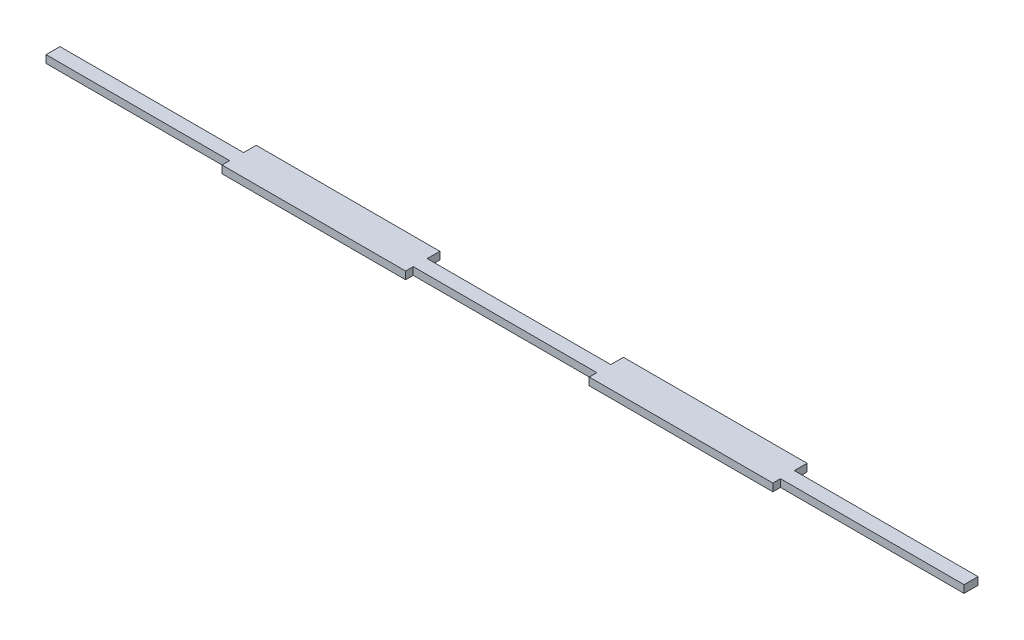
ISO-10303-21;
HEADER;
FILE_DESCRIPTION(('STEP AP214'),'2;1');
FILE_NAME('part.step','',(''),(''),'','','');
FILE_SCHEMA(('AUTOMOTIVE_DESIGN { 1 0 10303 214 1 1 1 1 }'));
ENDSEC;
DATA;
#1=APPLICATION_CONTEXT('core data for automotive mechanical design processes');
#2=APPLICATION_PROTOCOL_DEFINITION('international standard','automotive_design',2000,#1);
#3=PRODUCT_CONTEXT('',#1,'mechanical');
#4=PRODUCT('Part','Part','',(#3));
#5=PRODUCT_RELATED_PRODUCT_CATEGORY('part','',(#4));
#6=PRODUCT_DEFINITION_FORMATION('','',#4);
#7=PRODUCT_DEFINITION_CONTEXT('part definition',#1,'design');
#8=PRODUCT_DEFINITION('design','',#6,#7);
#9=PRODUCT_DEFINITION_SHAPE('','',#8);
#10=(LENGTH_UNIT() NAMED_UNIT(*) SI_UNIT(.MILLI.,.METRE.));
#11=(NAMED_UNIT(*) PLANE_ANGLE_UNIT() SI_UNIT($,.RADIAN.));
#12=(NAMED_UNIT(*) SI_UNIT($,.STERADIAN.) SOLID_ANGLE_UNIT());
#13=UNCERTAINTY_MEASURE_WITH_UNIT(LENGTH_MEASURE(1.E-05),#10,'distance_accuracy_value','');
#14=(GEOMETRIC_REPRESENTATION_CONTEXT(3) GLOBAL_UNCERTAINTY_ASSIGNED_CONTEXT((#13)) GLOBAL_UNIT_ASSIGNED_CONTEXT((#10,
#11,#12)) REPRESENTATION_CONTEXT('',''));
#15=CARTESIAN_POINT('',(0.,0.,0.));
#16=DIRECTION('',(0.,0.,1.));
#17=DIRECTION('',(1.,0.,0.));
#18=AXIS2_PLACEMENT_3D('',#15,#16,#17);
#19=CARTESIAN_POINT('',(-108.69,3.,-1.75));
#20=DIRECTION('',(0.,0.,1.));
#21=DIRECTION('',(1.,0.,0.));
#22=AXIS2_PLACEMENT_3D('',#19,#20,#21);
#23=PLANE('',#22);
#24=DIRECTION('',(-1.,0.,0.));
#25=VECTOR('',#24,1.);
#26=CARTESIAN_POINT('',(-108.69,0.,-1.75));
#27=LINE('',#26,#25);
#28=CARTESIAN_POINT('',(-108.69,0.,-1.75));
#29=VERTEX_POINT('',#28);
#30=CARTESIAN_POINT('',(-181.15,0.,-1.75));
#31=VERTEX_POINT('',#30);
#32=EDGE_CURVE('E200',#29,#31,#27,.T.);
#33=ORIENTED_EDGE('',*,*,#32,.T.);
#34=DIRECTION('',(0.,-1.,0.));
#35=VECTOR('',#34,1.);
#36=CARTESIAN_POINT('',(-181.15,3.,-1.75));
#37=LINE('',#36,#35);
#38=CARTESIAN_POINT('',(-181.15,3.,-1.75));
#39=VERTEX_POINT('',#38);
#40=EDGE_CURVE('E11',#39,#31,#37,.T.);
#41=ORIENTED_EDGE('',*,*,#40,.F.);
#42=DIRECTION('',(-1.,0.,0.));
#43=VECTOR('',#42,1.);
#44=CARTESIAN_POINT('',(-108.69,3.,-1.75));
#45=LINE('',#44,#43);
#46=CARTESIAN_POINT('',(-108.69,3.,-1.75));
#47=VERTEX_POINT('',#46);
#48=EDGE_CURVE('E238',#47,#39,#45,.T.);
#49=ORIENTED_EDGE('',*,*,#48,.F.);
#50=DIRECTION('',(0.,-1.,0.));
#51=VECTOR('',#50,1.);
#52=CARTESIAN_POINT('',(-108.69,3.,-1.75));
#53=LINE('',#52,#51);
#54=EDGE_CURVE('E196',#47,#29,#53,.T.);
#55=ORIENTED_EDGE('',*,*,#54,.T.);
#56=EDGE_LOOP('',(#33,#41,#49,#55));
#57=FACE_BOUND('',#56,.T.);
#58=ADVANCED_FACE('F32',(#57),#23,.F.);
#59=CARTESIAN_POINT('',(-181.15,3.,-1.75));
#60=DIRECTION('',(1.,0.,0.));
#61=DIRECTION('',(0.,0.,-1.));
#62=AXIS2_PLACEMENT_3D('',#59,#60,#61);
#63=PLANE('',#62);
#64=DIRECTION('',(0.,0.,1.));
#65=VECTOR('',#64,1.);
#66=CARTESIAN_POINT('',(-181.15,0.,-1.75));
#67=LINE('',#66,#65);
#68=CARTESIAN_POINT('',(-181.15,0.,3.75));
#69=VERTEX_POINT('',#68);
#70=EDGE_CURVE('E203',#31,#69,#67,.T.);
#71=ORIENTED_EDGE('',*,*,#70,.T.);
#72=DIRECTION('',(0.,-1.,0.));
#73=VECTOR('',#72,1.);
#74=CARTESIAN_POINT('',(-181.15,3.,3.75));
#75=LINE('',#74,#73);
#76=CARTESIAN_POINT('',(-181.15,3.,3.75));
#77=VERTEX_POINT('',#76);
#78=EDGE_CURVE('E40',#77,#69,#75,.T.);
#79=ORIENTED_EDGE('',*,*,#78,.F.);
#80=DIRECTION('',(0.,0.,1.));
#81=VECTOR('',#80,1.);
#82=CARTESIAN_POINT('',(-181.15,3.,-1.75));
#83=LINE('',#82,#81);
#84=EDGE_CURVE('E127',#39,#77,#83,.T.);
#85=ORIENTED_EDGE('',*,*,#84,.F.);
#86=ORIENTED_EDGE('',*,*,#40,.T.);
#87=EDGE_LOOP('',(#71,#79,#85,#86));
#88=FACE_BOUND('',#87,.T.);
#89=ADVANCED_FACE('F356',(#88),#63,.F.);
#90=CARTESIAN_POINT('',(-181.15,3.,3.75));
#91=DIRECTION('',(0.,0.,-1.));
#92=DIRECTION('',(-1.,0.,0.));
#93=AXIS2_PLACEMENT_3D('',#90,#91,#92);
#94=PLANE('',#93);
#95=DIRECTION('',(1.,0.,0.));
#96=VECTOR('',#95,1.);
#97=CARTESIAN_POINT('',(-181.15,0.,3.75));
#98=LINE('',#97,#96);
#99=CARTESIAN_POINT('',(-108.69,0.,3.75));
#100=VERTEX_POINT('',#99);
#101=EDGE_CURVE('E205',#69,#100,#98,.T.);
#102=ORIENTED_EDGE('',*,*,#101,.T.);
#103=DIRECTION('',(0.,-1.,0.));
#104=VECTOR('',#103,1.);
#105=CARTESIAN_POINT('',(-108.69,3.,3.75));
#106=LINE('',#105,#104);
#107=CARTESIAN_POINT('',(-108.69,3.,3.75));
#108=VERTEX_POINT('',#107);
#109=EDGE_CURVE('E281',#108,#100,#106,.T.);
#110=ORIENTED_EDGE('',*,*,#109,.F.);
#111=DIRECTION('',(1.,0.,0.));
#112=VECTOR('',#111,1.);
#113=CARTESIAN_POINT('',(-181.15,3.,3.75));
#114=LINE('',#113,#112);
#115=EDGE_CURVE('E289',#77,#108,#114,.T.);
#116=ORIENTED_EDGE('',*,*,#115,.F.);
#117=ORIENTED_EDGE('',*,*,#78,.T.);
#118=EDGE_LOOP('',(#102,#110,#116,#117));
#119=FACE_BOUND('',#118,.T.);
#120=ADVANCED_FACE('F287',(#119),#94,.F.);
#121=CARTESIAN_POINT('',(-108.69,3.,3.75));
#122=DIRECTION('',(1.,0.,0.));
#123=DIRECTION('',(0.,0.,-1.));
#124=AXIS2_PLACEMENT_3D('',#121,#122,#123);
#125=PLANE('',#124);
#126=DIRECTION('',(0.,0.,1.));
#127=VECTOR('',#126,1.);
#128=CARTESIAN_POINT('',(-108.69,0.,3.75));
#129=LINE('',#128,#127);
#130=CARTESIAN_POINT('',(-108.69,0.,6.75));
#131=VERTEX_POINT('',#130);
#132=EDGE_CURVE('E207',#100,#131,#129,.T.);
#133=ORIENTED_EDGE('',*,*,#132,.T.);
#134=DIRECTION('',(0.,-1.,0.));
#135=VECTOR('',#134,1.);
#136=CARTESIAN_POINT('',(-108.69,3.,6.75));
#137=LINE('',#136,#135);
#138=CARTESIAN_POINT('',(-108.69,3.,6.75));
#139=VERTEX_POINT('',#138);
#140=EDGE_CURVE('E278',#139,#131,#137,.T.);
#141=ORIENTED_EDGE('',*,*,#140,.F.);
#142=DIRECTION('',(0.,0.,1.));
#143=VECTOR('',#142,1.);
#144=CARTESIAN_POINT('',(-108.69,3.,3.75));
#145=LINE('',#144,#143);
#146=EDGE_CURVE('E307',#108,#139,#145,.T.);
#147=ORIENTED_EDGE('',*,*,#146,.F.);
#148=ORIENTED_EDGE('',*,*,#109,.T.);
#149=EDGE_LOOP('',(#133,#141,#147,#148));
#150=FACE_BOUND('',#149,.T.);
#151=ADVANCED_FACE('F298',(#150),#125,.F.);
#152=CARTESIAN_POINT('',(-108.69,3.,6.75));
#153=DIRECTION('',(0.,0.,-1.));
#154=DIRECTION('',(-1.,0.,0.));
#155=AXIS2_PLACEMENT_3D('',#152,#153,#154);
#156=PLANE('',#155);
#157=DIRECTION('',(1.,0.,0.));
#158=VECTOR('',#157,1.);
#159=CARTESIAN_POINT('',(-108.69,0.,6.75));
#160=LINE('',#159,#158);
#161=CARTESIAN_POINT('',(-36.23,0.,6.75));
#162=VERTEX_POINT('',#161);
#163=EDGE_CURVE('E209',#131,#162,#160,.T.);
#164=ORIENTED_EDGE('',*,*,#163,.T.);
#165=DIRECTION('',(0.,-1.,0.));
#166=VECTOR('',#165,1.);
#167=CARTESIAN_POINT('',(-36.23,3.,6.75));
#168=LINE('',#167,#166);
#169=CARTESIAN_POINT('',(-36.23,3.,6.75));
#170=VERTEX_POINT('',#169);
#171=EDGE_CURVE('E275',#170,#162,#168,.T.);
#172=ORIENTED_EDGE('',*,*,#171,.F.);
#173=DIRECTION('',(1.,0.,0.));
#174=VECTOR('',#173,1.);
#175=CARTESIAN_POINT('',(-108.69,3.,6.75));
#176=LINE('',#175,#174);
#177=EDGE_CURVE('E304',#139,#170,#176,.T.);
#178=ORIENTED_EDGE('',*,*,#177,.F.);
#179=ORIENTED_EDGE('',*,*,#140,.T.);
#180=EDGE_LOOP('',(#164,#172,#178,#179));
#181=FACE_BOUND('',#180,.T.);
#182=ADVANCED_FACE('F302',(#181),#156,.F.);
#183=CARTESIAN_POINT('',(-36.23,3.,3.75));
#184=DIRECTION('',(-1.,0.,0.));
#185=DIRECTION('',(0.,0.,1.));
#186=AXIS2_PLACEMENT_3D('',#183,#184,#185);
#187=PLANE('',#186);
#188=DIRECTION('',(0.,0.,-1.));
#189=VECTOR('',#188,1.);
#190=CARTESIAN_POINT('',(-36.23,0.,3.75));
#191=LINE('',#190,#189);
#192=CARTESIAN_POINT('',(-36.23,0.,3.75));
#193=VERTEX_POINT('',#192);
#194=EDGE_CURVE('E211',#162,#193,#191,.T.);
#195=ORIENTED_EDGE('',*,*,#194,.T.);
#196=DIRECTION('',(0.,-1.,0.));
#197=VECTOR('',#196,1.);
#198=CARTESIAN_POINT('',(-36.23,3.,3.75));
#199=LINE('',#198,#197);
#200=CARTESIAN_POINT('',(-36.23,3.,3.75));
#201=VERTEX_POINT('',#200);
#202=EDGE_CURVE('E272',#201,#193,#199,.T.);
#203=ORIENTED_EDGE('',*,*,#202,.F.);
#204=DIRECTION('',(0.,0.,-1.));
#205=VECTOR('',#204,1.);
#206=CARTESIAN_POINT('',(-36.23,3.,3.75));
#207=LINE('',#206,#205);
#208=EDGE_CURVE('E306',#170,#201,#207,.T.);
#209=ORIENTED_EDGE('',*,*,#208,.F.);
#210=ORIENTED_EDGE('',*,*,#171,.T.);
#211=EDGE_LOOP('',(#195,#203,#209,#210));
#212=FACE_BOUND('',#211,.T.);
#213=ADVANCED_FACE('F369',(#212),#187,.F.);
#214=CARTESIAN_POINT('',(-36.23,3.,3.75));
#215=DIRECTION('',(0.,0.,-1.));
#216=DIRECTION('',(-1.,0.,0.));
#217=AXIS2_PLACEMENT_3D('',#214,#215,#216);
#218=PLANE('',#217);
#219=DIRECTION('',(1.,0.,0.));
#220=VECTOR('',#219,1.);
#221=CARTESIAN_POINT('',(-36.23,0.,3.75));
#222=LINE('',#221,#220);
#223=CARTESIAN_POINT('',(36.23,0.,3.75));
#224=VERTEX_POINT('',#223);
#225=EDGE_CURVE('E213',#193,#224,#222,.T.);
#226=ORIENTED_EDGE('',*,*,#225,.T.);
#227=DIRECTION('',(0.,-1.,0.));
#228=VECTOR('',#227,1.);
#229=CARTESIAN_POINT('',(36.23,3.,3.75));
#230=LINE('',#229,#228);
#231=CARTESIAN_POINT('',(36.23,3.,3.75));
#232=VERTEX_POINT('',#231);
#233=EDGE_CURVE('E269',#232,#224,#230,.T.);
#234=ORIENTED_EDGE('',*,*,#233,.F.);
#235=DIRECTION('',(1.,0.,0.));
#236=VECTOR('',#235,1.);
#237=CARTESIAN_POINT('',(-36.23,3.,3.75));
#238=LINE('',#237,#236);
#239=EDGE_CURVE('E309',#201,#232,#238,.T.);
#240=ORIENTED_EDGE('',*,*,#239,.F.);
#241=ORIENTED_EDGE('',*,*,#202,.T.);
#242=EDGE_LOOP('',(#226,#234,#240,#241));
#243=FACE_BOUND('',#242,.T.);
#244=ADVANCED_FACE('F372',(#243),#218,.F.);
#245=CARTESIAN_POINT('',(36.23,3.,3.75));
#246=DIRECTION('',(1.,0.,0.));
#247=DIRECTION('',(0.,0.,-1.));
#248=AXIS2_PLACEMENT_3D('',#245,#246,#247);
#249=PLANE('',#248);
#250=DIRECTION('',(0.,0.,1.));
#251=VECTOR('',#250,1.);
#252=CARTESIAN_POINT('',(36.23,0.,3.75));
#253=LINE('',#252,#251);
#254=CARTESIAN_POINT('',(36.23,0.,6.75));
#255=VERTEX_POINT('',#254);
#256=EDGE_CURVE('E215',#224,#255,#253,.T.);
#257=ORIENTED_EDGE('',*,*,#256,.T.);
#258=DIRECTION('',(0.,-1.,0.));
#259=VECTOR('',#258,1.);
#260=CARTESIAN_POINT('',(36.23,3.,6.75));
#261=LINE('',#260,#259);
#262=CARTESIAN_POINT('',(36.23,3.,6.75));
#263=VERTEX_POINT('',#262);
#264=EDGE_CURVE('E266',#263,#255,#261,.T.);
#265=ORIENTED_EDGE('',*,*,#264,.F.);
#266=DIRECTION('',(0.,0.,1.));
#267=VECTOR('',#266,1.);
#268=CARTESIAN_POINT('',(36.23,3.,3.75));
#269=LINE('',#268,#267);
#270=EDGE_CURVE('E315',#232,#263,#269,.T.);
#271=ORIENTED_EDGE('',*,*,#270,.F.);
#272=ORIENTED_EDGE('',*,*,#233,.T.);
#273=EDGE_LOOP('',(#257,#265,#271,#272));
#274=FACE_BOUND('',#273,.T.);
#275=ADVANCED_FACE('F376',(#274),#249,.F.);
#276=CARTESIAN_POINT('',(36.23,3.,6.75));
#277=DIRECTION('',(0.,0.,-1.));
#278=DIRECTION('',(-1.,0.,0.));
#279=AXIS2_PLACEMENT_3D('',#276,#277,#278);
#280=PLANE('',#279);
#281=DIRECTION('',(1.,0.,0.));
#282=VECTOR('',#281,1.);
#283=CARTESIAN_POINT('',(36.23,0.,6.75));
#284=LINE('',#283,#282);
#285=CARTESIAN_POINT('',(108.69,0.,6.75));
#286=VERTEX_POINT('',#285);
#287=EDGE_CURVE('E217',#255,#286,#284,.T.);
#288=ORIENTED_EDGE('',*,*,#287,.T.);
#289=DIRECTION('',(0.,-1.,0.));
#290=VECTOR('',#289,1.);
#291=CARTESIAN_POINT('',(108.69,3.,6.75));
#292=LINE('',#291,#290);
#293=CARTESIAN_POINT('',(108.69,3.,6.75));
#294=VERTEX_POINT('',#293);
#295=EDGE_CURVE('E263',#294,#286,#292,.T.);
#296=ORIENTED_EDGE('',*,*,#295,.F.);
#297=DIRECTION('',(1.,0.,0.));
#298=VECTOR('',#297,1.);
#299=CARTESIAN_POINT('',(36.23,3.,6.75));
#300=LINE('',#299,#298);
#301=EDGE_CURVE('E317',#263,#294,#300,.T.);
#302=ORIENTED_EDGE('',*,*,#301,.F.);
#303=ORIENTED_EDGE('',*,*,#264,.T.);
#304=EDGE_LOOP('',(#288,#296,#302,#303));
#305=FACE_BOUND('',#304,.T.);
#306=ADVANCED_FACE('F380',(#305),#280,.F.);
#307=CARTESIAN_POINT('',(108.69,3.,3.75));
#308=DIRECTION('',(-1.,0.,0.));
#309=DIRECTION('',(0.,0.,1.));
#310=AXIS2_PLACEMENT_3D('',#307,#308,#309);
#311=PLANE('',#310);
#312=DIRECTION('',(0.,0.,-1.));
#313=VECTOR('',#312,1.);
#314=CARTESIAN_POINT('',(108.69,0.,3.75));
#315=LINE('',#314,#313);
#316=CARTESIAN_POINT('',(108.69,0.,3.75));
#317=VERTEX_POINT('',#316);
#318=EDGE_CURVE('E219',#286,#317,#315,.T.);
#319=ORIENTED_EDGE('',*,*,#318,.T.);
#320=DIRECTION('',(0.,-1.,0.));
#321=VECTOR('',#320,1.);
#322=CARTESIAN_POINT('',(108.69,3.,3.75));
#323=LINE('',#322,#321);
#324=CARTESIAN_POINT('',(108.69,3.,3.75));
#325=VERTEX_POINT('',#324);
#326=EDGE_CURVE('E260',#325,#317,#323,.T.);
#327=ORIENTED_EDGE('',*,*,#326,.F.);
#328=DIRECTION('',(0.,0.,-1.));
#329=VECTOR('',#328,1.);
#330=CARTESIAN_POINT('',(108.69,3.,3.75));
#331=LINE('',#330,#329);
#332=EDGE_CURVE('E319',#294,#325,#331,.T.);
#333=ORIENTED_EDGE('',*,*,#332,.F.);
#334=ORIENTED_EDGE('',*,*,#295,.T.);
#335=EDGE_LOOP('',(#319,#327,#333,#334));
#336=FACE_BOUND('',#335,.T.);
#337=ADVANCED_FACE('F384',(#336),#311,.F.);
#338=CARTESIAN_POINT('',(108.69,3.,3.75));
#339=DIRECTION('',(0.,0.,-1.));
#340=DIRECTION('',(-1.,0.,0.));
#341=AXIS2_PLACEMENT_3D('',#338,#339,#340);
#342=PLANE('',#341);
#343=DIRECTION('',(1.,0.,0.));
#344=VECTOR('',#343,1.);
#345=CARTESIAN_POINT('',(108.69,0.,3.75));
#346=LINE('',#345,#344);
#347=CARTESIAN_POINT('',(181.15,0.,3.75));
#348=VERTEX_POINT('',#347);
#349=EDGE_CURVE('E221',#317,#348,#346,.T.);
#350=ORIENTED_EDGE('',*,*,#349,.T.);
#351=DIRECTION('',(0.,-1.,0.));
#352=VECTOR('',#351,1.);
#353=CARTESIAN_POINT('',(181.15,3.,3.75));
#354=LINE('',#353,#352);
#355=CARTESIAN_POINT('',(181.15,3.,3.75));
#356=VERTEX_POINT('',#355);
#357=EDGE_CURVE('E257',#356,#348,#354,.T.);
#358=ORIENTED_EDGE('',*,*,#357,.F.);
#359=DIRECTION('',(1.,0.,0.));
#360=VECTOR('',#359,1.);
#361=CARTESIAN_POINT('',(108.69,3.,3.75));
#362=LINE('',#361,#360);
#363=EDGE_CURVE('E321',#325,#356,#362,.T.);
#364=ORIENTED_EDGE('',*,*,#363,.F.);
#365=ORIENTED_EDGE('',*,*,#326,.T.);
#366=EDGE_LOOP('',(#350,#358,#364,#365));
#367=FACE_BOUND('',#366,.T.);
#368=ADVANCED_FACE('F388',(#367),#342,.F.);
#369=CARTESIAN_POINT('',(181.15,3.,-1.75));
#370=DIRECTION('',(-1.,0.,0.));
#371=DIRECTION('',(0.,0.,1.));
#372=AXIS2_PLACEMENT_3D('',#369,#370,#371);
#373=PLANE('',#372);
#374=DIRECTION('',(0.,0.,-1.));
#375=VECTOR('',#374,1.);
#376=CARTESIAN_POINT('',(181.15,0.,-1.75));
#377=LINE('',#376,#375);
#378=CARTESIAN_POINT('',(181.15,0.,-1.75));
#379=VERTEX_POINT('',#378);
#380=EDGE_CURVE('E223',#348,#379,#377,.T.);
#381=ORIENTED_EDGE('',*,*,#380,.T.);
#382=DIRECTION('',(0.,-1.,0.));
#383=VECTOR('',#382,1.);
#384=CARTESIAN_POINT('',(181.15,3.,-1.75));
#385=LINE('',#384,#383);
#386=CARTESIAN_POINT('',(181.15,3.,-1.75));
#387=VERTEX_POINT('',#386);
#388=EDGE_CURVE('E254',#387,#379,#385,.T.);
#389=ORIENTED_EDGE('',*,*,#388,.F.);
#390=DIRECTION('',(0.,0.,-1.));
#391=VECTOR('',#390,1.);
#392=CARTESIAN_POINT('',(181.15,3.,-1.75));
#393=LINE('',#392,#391);
#394=EDGE_CURVE('E323',#356,#387,#393,.T.);
#395=ORIENTED_EDGE('',*,*,#394,.F.);
#396=ORIENTED_EDGE('',*,*,#357,.T.);
#397=EDGE_LOOP('',(#381,#389,#395,#396));
#398=FACE_BOUND('',#397,.T.);
#399=ADVANCED_FACE('F392',(#398),#373,.F.);
#400=CARTESIAN_POINT('',(108.69,3.,-1.75));
#401=DIRECTION('',(0.,0.,1.));
#402=DIRECTION('',(1.,0.,0.));
#403=AXIS2_PLACEMENT_3D('',#400,#401,#402);
#404=PLANE('',#403);
#405=DIRECTION('',(-1.,0.,0.));
#406=VECTOR('',#405,1.);
#407=CARTESIAN_POINT('',(108.69,0.,-1.75));
#408=LINE('',#407,#406);
#409=CARTESIAN_POINT('',(108.69,0.,-1.75));
#410=VERTEX_POINT('',#409);
#411=EDGE_CURVE('E225',#379,#410,#408,.T.);
#412=ORIENTED_EDGE('',*,*,#411,.T.);
#413=DIRECTION('',(0.,-1.,0.));
#414=VECTOR('',#413,1.);
#415=CARTESIAN_POINT('',(108.69,3.,-1.75));
#416=LINE('',#415,#414);
#417=CARTESIAN_POINT('',(108.69,3.,-1.75));
#418=VERTEX_POINT('',#417);
#419=EDGE_CURVE('E251',#418,#410,#416,.T.);
#420=ORIENTED_EDGE('',*,*,#419,.F.);
#421=DIRECTION('',(-1.,0.,0.));
#422=VECTOR('',#421,1.);
#423=CARTESIAN_POINT('',(108.69,3.,-1.75));
#424=LINE('',#423,#422);
#425=EDGE_CURVE('E325',#387,#418,#424,.T.);
#426=ORIENTED_EDGE('',*,*,#425,.F.);
#427=ORIENTED_EDGE('',*,*,#388,.T.);
#428=EDGE_LOOP('',(#412,#420,#426,#427));
#429=FACE_BOUND('',#428,.T.);
#430=ADVANCED_FACE('F396',(#429),#404,.F.);
#431=CARTESIAN_POINT('',(108.69,3.,-6.75));
#432=DIRECTION('',(-1.,0.,0.));
#433=DIRECTION('',(0.,0.,1.));
#434=AXIS2_PLACEMENT_3D('',#431,#432,#433);
#435=PLANE('',#434);
#436=DIRECTION('',(0.,0.,-1.));
#437=VECTOR('',#436,1.);
#438=CARTESIAN_POINT('',(108.69,0.,-6.75));
#439=LINE('',#438,#437);
#440=CARTESIAN_POINT('',(108.69,0.,-6.75));
#441=VERTEX_POINT('',#440);
#442=EDGE_CURVE('E227',#410,#441,#439,.T.);
#443=ORIENTED_EDGE('',*,*,#442,.T.);
#444=DIRECTION('',(0.,-1.,0.));
#445=VECTOR('',#444,1.);
#446=CARTESIAN_POINT('',(108.69,3.,-6.75));
#447=LINE('',#446,#445);
#448=CARTESIAN_POINT('',(108.69,3.,-6.75));
#449=VERTEX_POINT('',#448);
#450=EDGE_CURVE('E248',#449,#441,#447,.T.);
#451=ORIENTED_EDGE('',*,*,#450,.F.);
#452=DIRECTION('',(0.,0.,-1.));
#453=VECTOR('',#452,1.);
#454=CARTESIAN_POINT('',(108.69,3.,-6.75));
#455=LINE('',#454,#453);
#456=EDGE_CURVE('E327',#418,#449,#455,.T.);
#457=ORIENTED_EDGE('',*,*,#456,.F.);
#458=ORIENTED_EDGE('',*,*,#419,.T.);
#459=EDGE_LOOP('',(#443,#451,#457,#458));
#460=FACE_BOUND('',#459,.T.);
#461=ADVANCED_FACE('F400',(#460),#435,.F.);
#462=CARTESIAN_POINT('',(36.23,3.,-6.75));
#463=DIRECTION('',(0.,0.,1.));
#464=DIRECTION('',(1.,0.,0.));
#465=AXIS2_PLACEMENT_3D('',#462,#463,#464);
#466=PLANE('',#465);
#467=DIRECTION('',(-1.,0.,0.));
#468=VECTOR('',#467,1.);
#469=CARTESIAN_POINT('',(36.23,0.,-6.75));
#470=LINE('',#469,#468);
#471=CARTESIAN_POINT('',(36.23,0.,-6.75));
#472=VERTEX_POINT('',#471);
#473=EDGE_CURVE('E229',#441,#472,#470,.T.);
#474=ORIENTED_EDGE('',*,*,#473,.T.);
#475=DIRECTION('',(0.,-1.,0.));
#476=VECTOR('',#475,1.);
#477=CARTESIAN_POINT('',(36.23,3.,-6.75));
#478=LINE('',#477,#476);
#479=CARTESIAN_POINT('',(36.23,3.,-6.75));
#480=VERTEX_POINT('',#479);
#481=EDGE_CURVE('E245',#480,#472,#478,.T.);
#482=ORIENTED_EDGE('',*,*,#481,.F.);
#483=DIRECTION('',(-1.,0.,0.));
#484=VECTOR('',#483,1.);
#485=CARTESIAN_POINT('',(36.23,3.,-6.75));
#486=LINE('',#485,#484);
#487=EDGE_CURVE('E329',#449,#480,#486,.T.);
#488=ORIENTED_EDGE('',*,*,#487,.F.);
#489=ORIENTED_EDGE('',*,*,#450,.T.);
#490=EDGE_LOOP('',(#474,#482,#488,#489));
#491=FACE_BOUND('',#490,.T.);
#492=ADVANCED_FACE('F404',(#491),#466,.F.);
#493=CARTESIAN_POINT('',(36.23,3.,-6.75));
#494=DIRECTION('',(1.,0.,0.));
#495=DIRECTION('',(0.,0.,-1.));
#496=AXIS2_PLACEMENT_3D('',#493,#494,#495);
#497=PLANE('',#496);
#498=DIRECTION('',(0.,0.,1.));
#499=VECTOR('',#498,1.);
#500=CARTESIAN_POINT('',(36.23,0.,-6.75));
#501=LINE('',#500,#499);
#502=CARTESIAN_POINT('',(36.2300000000001,0.,-1.75));
#503=VERTEX_POINT('',#502);
#504=EDGE_CURVE('E231',#472,#503,#501,.T.);
#505=ORIENTED_EDGE('',*,*,#504,.T.);
#506=DIRECTION('',(0.,-1.,0.));
#507=VECTOR('',#506,1.);
#508=CARTESIAN_POINT('',(36.2300000000001,3.,-1.75));
#509=LINE('',#508,#507);
#510=CARTESIAN_POINT('',(36.2300000000001,3.,-1.75));
#511=VERTEX_POINT('',#510);
#512=EDGE_CURVE('E242',#511,#503,#509,.T.);
#513=ORIENTED_EDGE('',*,*,#512,.F.);
#514=DIRECTION('',(0.,0.,1.));
#515=VECTOR('',#514,1.);
#516=CARTESIAN_POINT('',(36.23,3.,-6.75));
#517=LINE('',#516,#515);
#518=EDGE_CURVE('E331',#480,#511,#517,.T.);
#519=ORIENTED_EDGE('',*,*,#518,.F.);
#520=ORIENTED_EDGE('',*,*,#481,.T.);
#521=EDGE_LOOP('',(#505,#513,#519,#520));
#522=FACE_BOUND('',#521,.T.);
#523=ADVANCED_FACE('F337',(#522),#497,.F.);
#524=CARTESIAN_POINT('',(-36.23,3.,-1.75));
#525=DIRECTION('',(0.,0.,1.));
#526=DIRECTION('',(1.,0.,0.));
#527=AXIS2_PLACEMENT_3D('',#524,#525,#526);
#528=PLANE('',#527);
#529=DIRECTION('',(-1.,0.,0.));
#530=VECTOR('',#529,1.);
#531=CARTESIAN_POINT('',(-36.23,0.,-1.75));
#532=LINE('',#531,#530);
#533=CARTESIAN_POINT('',(-36.23,0.,-1.75));
#534=VERTEX_POINT('',#533);
#535=EDGE_CURVE('E233',#503,#534,#532,.T.);
#536=ORIENTED_EDGE('',*,*,#535,.T.);
#537=DIRECTION('',(0.,-1.,0.));
#538=VECTOR('',#537,1.);
#539=CARTESIAN_POINT('',(-36.23,3.,-1.75));
#540=LINE('',#539,#538);
#541=CARTESIAN_POINT('',(-36.23,3.,-1.75));
#542=VERTEX_POINT('',#541);
#543=EDGE_CURVE('E191',#542,#534,#540,.T.);
#544=ORIENTED_EDGE('',*,*,#543,.F.);
#545=DIRECTION('',(-1.,0.,0.));
#546=VECTOR('',#545,1.);
#547=CARTESIAN_POINT('',(-36.23,3.,-1.75));
#548=LINE('',#547,#546);
#549=EDGE_CURVE('E182',#511,#542,#548,.T.);
#550=ORIENTED_EDGE('',*,*,#549,.F.);
#551=ORIENTED_EDGE('',*,*,#512,.T.);
#552=EDGE_LOOP('',(#536,#544,#550,#551));
#553=FACE_BOUND('',#552,.T.);
#554=ADVANCED_FACE('F341',(#553),#528,.F.);
#555=CARTESIAN_POINT('',(-36.23,3.,-6.75));
#556=DIRECTION('',(-1.,0.,0.));
#557=DIRECTION('',(0.,0.,1.));
#558=AXIS2_PLACEMENT_3D('',#555,#556,#557);
#559=PLANE('',#558);
#560=DIRECTION('',(0.,0.,-1.));
#561=VECTOR('',#560,1.);
#562=CARTESIAN_POINT('',(-36.23,0.,-6.75));
#563=LINE('',#562,#561);
#564=CARTESIAN_POINT('',(-36.23,0.,-6.75));
#565=VERTEX_POINT('',#564);
#566=EDGE_CURVE('E190',#534,#565,#563,.T.);
#567=ORIENTED_EDGE('',*,*,#566,.T.);
#568=DIRECTION('',(0.,-1.,0.));
#569=VECTOR('',#568,1.);
#570=CARTESIAN_POINT('',(-36.23,3.,-6.75));
#571=LINE('',#570,#569);
#572=CARTESIAN_POINT('',(-36.23,3.,-6.75));
#573=VERTEX_POINT('',#572);
#574=EDGE_CURVE('E187',#573,#565,#571,.T.);
#575=ORIENTED_EDGE('',*,*,#574,.F.);
#576=DIRECTION('',(0.,0.,-1.));
#577=VECTOR('',#576,1.);
#578=CARTESIAN_POINT('',(-36.23,3.,-6.75));
#579=LINE('',#578,#577);
#580=EDGE_CURVE('E176',#542,#573,#579,.T.);
#581=ORIENTED_EDGE('',*,*,#580,.F.);
#582=ORIENTED_EDGE('',*,*,#543,.T.);
#583=EDGE_LOOP('',(#567,#575,#581,#582));
#584=FACE_BOUND('',#583,.T.);
#585=ADVANCED_FACE('F188',(#584),#559,.F.);
#586=CARTESIAN_POINT('',(-108.69,3.,-6.75));
#587=DIRECTION('',(0.,0.,1.));
#588=DIRECTION('',(1.,0.,0.));
#589=AXIS2_PLACEMENT_3D('',#586,#587,#588);
#590=PLANE('',#589);
#591=DIRECTION('',(-1.,0.,0.));
#592=VECTOR('',#591,1.);
#593=CARTESIAN_POINT('',(-108.69,0.,-6.75));
#594=LINE('',#593,#592);
#595=CARTESIAN_POINT('',(-108.69,0.,-6.75));
#596=VERTEX_POINT('',#595);
#597=EDGE_CURVE('E113',#565,#596,#594,.T.);
#598=ORIENTED_EDGE('',*,*,#597,.T.);
#599=DIRECTION('',(0.,-1.,0.));
#600=VECTOR('',#599,1.);
#601=CARTESIAN_POINT('',(-108.69,3.,-6.75));
#602=LINE('',#601,#600);
#603=CARTESIAN_POINT('',(-108.69,3.,-6.75));
#604=VERTEX_POINT('',#603);
#605=EDGE_CURVE('E192',#604,#596,#602,.T.);
#606=ORIENTED_EDGE('',*,*,#605,.F.);
#607=DIRECTION('',(-1.,0.,0.));
#608=VECTOR('',#607,1.);
#609=CARTESIAN_POINT('',(-108.69,3.,-6.75));
#610=LINE('',#609,#608);
#611=EDGE_CURVE('E180',#573,#604,#610,.T.);
#612=ORIENTED_EDGE('',*,*,#611,.F.);
#613=ORIENTED_EDGE('',*,*,#574,.T.);
#614=EDGE_LOOP('',(#598,#606,#612,#613));
#615=FACE_BOUND('',#614,.T.);
#616=ADVANCED_FACE('F194',(#615),#590,.F.);
#617=CARTESIAN_POINT('',(-108.69,3.,-6.75));
#618=DIRECTION('',(1.,0.,0.));
#619=DIRECTION('',(0.,0.,-1.));
#620=AXIS2_PLACEMENT_3D('',#617,#618,#619);
#621=PLANE('',#620);
#622=DIRECTION('',(0.,0.,1.));
#623=VECTOR('',#622,1.);
#624=CARTESIAN_POINT('',(-108.69,0.,-6.75));
#625=LINE('',#624,#623);
#626=EDGE_CURVE('E119',#596,#29,#625,.T.);
#627=ORIENTED_EDGE('',*,*,#626,.T.);
#628=ORIENTED_EDGE('',*,*,#54,.F.);
#629=DIRECTION('',(0.,0.,1.));
#630=VECTOR('',#629,1.);
#631=CARTESIAN_POINT('',(-108.69,3.,-6.75));
#632=LINE('',#631,#630);
#633=EDGE_CURVE('E48',#604,#47,#632,.T.);
#634=ORIENTED_EDGE('',*,*,#633,.F.);
#635=ORIENTED_EDGE('',*,*,#605,.T.);
#636=EDGE_LOOP('',(#627,#628,#634,#635));
#637=FACE_BOUND('',#636,.T.);
#638=ADVANCED_FACE('F345',(#637),#621,.F.);
#639=CARTESIAN_POINT('',(0.,3.,0.));
#640=DIRECTION('',(0.,1.,0.));
#641=DIRECTION('',(0.,0.,1.));
#642=AXIS2_PLACEMENT_3D('',#639,#640,#641);
#643=PLANE('',#642);
#644=ORIENTED_EDGE('',*,*,#48,.T.);
#645=ORIENTED_EDGE('',*,*,#84,.T.);
#646=ORIENTED_EDGE('',*,*,#115,.T.);
#647=ORIENTED_EDGE('',*,*,#146,.T.);
#648=ORIENTED_EDGE('',*,*,#177,.T.);
#649=ORIENTED_EDGE('',*,*,#208,.T.);
#650=ORIENTED_EDGE('',*,*,#239,.T.);
#651=ORIENTED_EDGE('',*,*,#270,.T.);
#652=ORIENTED_EDGE('',*,*,#301,.T.);
#653=ORIENTED_EDGE('',*,*,#332,.T.);
#654=ORIENTED_EDGE('',*,*,#363,.T.);
#655=ORIENTED_EDGE('',*,*,#394,.T.);
#656=ORIENTED_EDGE('',*,*,#425,.T.);
#657=ORIENTED_EDGE('',*,*,#456,.T.);
#658=ORIENTED_EDGE('',*,*,#487,.T.);
#659=ORIENTED_EDGE('',*,*,#518,.T.);
#660=ORIENTED_EDGE('',*,*,#549,.T.);
#661=ORIENTED_EDGE('',*,*,#580,.T.);
#662=ORIENTED_EDGE('',*,*,#611,.T.);
#663=ORIENTED_EDGE('',*,*,#633,.T.);
#664=EDGE_LOOP('',(#644,#645,#646,#647,#648,#649,#650,#651,#652,#653,#654,#655,#656,#657,#658,
#659,#660,#661,#662,#663));
#665=FACE_BOUND('',#664,.T.);
#666=ADVANCED_FACE('F178',(#665),#643,.T.);
#667=CARTESIAN_POINT('',(0.,0.,0.));
#668=DIRECTION('',(0.,1.,0.));
#669=DIRECTION('',(0.,0.,1.));
#670=AXIS2_PLACEMENT_3D('',#667,#668,#669);
#671=PLANE('',#670);
#672=ORIENTED_EDGE('',*,*,#32,.F.);
#673=ORIENTED_EDGE('',*,*,#626,.F.);
#674=ORIENTED_EDGE('',*,*,#597,.F.);
#675=ORIENTED_EDGE('',*,*,#566,.F.);
#676=ORIENTED_EDGE('',*,*,#535,.F.);
#677=ORIENTED_EDGE('',*,*,#504,.F.);
#678=ORIENTED_EDGE('',*,*,#473,.F.);
#679=ORIENTED_EDGE('',*,*,#442,.F.);
#680=ORIENTED_EDGE('',*,*,#411,.F.);
#681=ORIENTED_EDGE('',*,*,#380,.F.);
#682=ORIENTED_EDGE('',*,*,#349,.F.);
#683=ORIENTED_EDGE('',*,*,#318,.F.);
#684=ORIENTED_EDGE('',*,*,#287,.F.);
#685=ORIENTED_EDGE('',*,*,#256,.F.);
#686=ORIENTED_EDGE('',*,*,#225,.F.);
#687=ORIENTED_EDGE('',*,*,#194,.F.);
#688=ORIENTED_EDGE('',*,*,#163,.F.);
#689=ORIENTED_EDGE('',*,*,#132,.F.);
#690=ORIENTED_EDGE('',*,*,#101,.F.);
#691=ORIENTED_EDGE('',*,*,#70,.F.);
#692=EDGE_LOOP('',(#672,#673,#674,#675,#676,#677,#678,#679,#680,#681,#682,#683,#684,#685,#686,
#687,#688,#689,#690,#691));
#693=FACE_BOUND('',#692,.T.);
#694=ADVANCED_FACE('F293',(#693),#671,.F.);
#695=CLOSED_SHELL('',(#58,#89,#120,#151,#182,#213,#244,#275,#306,#337,#368,#399,#430,#461,#492,
#523,#554,#585,#616,#638,#666,#694));
#696=MANIFOLD_SOLID_BREP('B2',#695);
#697=ADVANCED_BREP_SHAPE_REPRESENTATION('',(#18,#696),#14);
#698=SHAPE_DEFINITION_REPRESENTATION(#9,#697);
ENDSEC;
END-ISO-10303-21;
